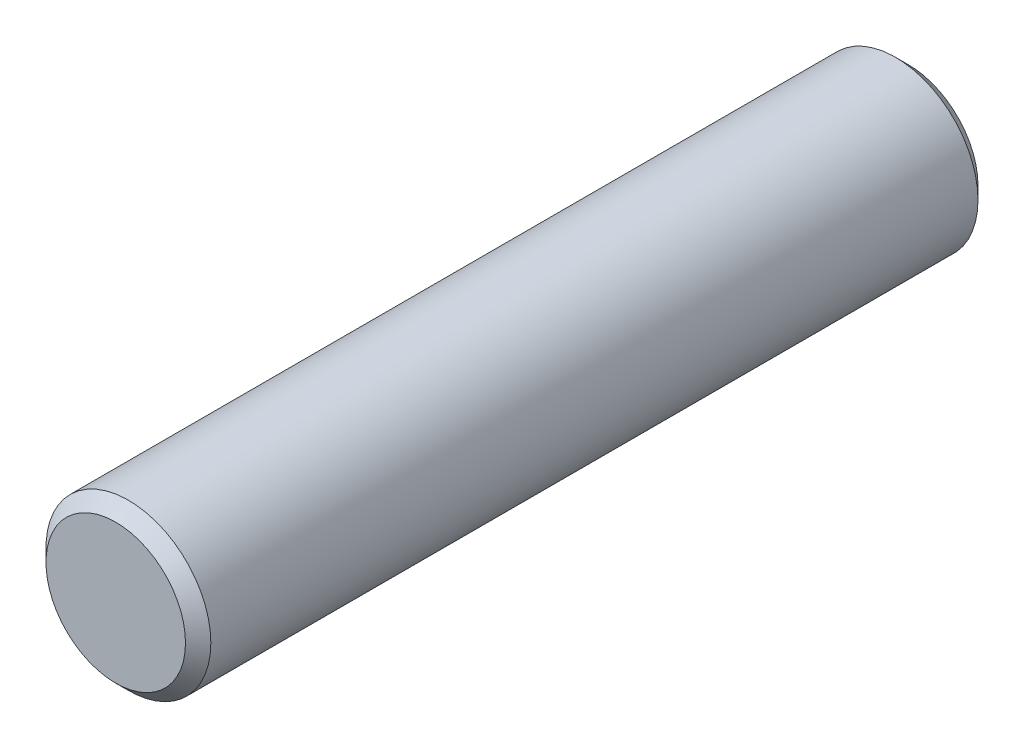
ISO-10303-21;
HEADER;
FILE_DESCRIPTION(('STEP AP214'),'2;1');
FILE_NAME('part.step','',(''),(''),'','','');
FILE_SCHEMA(('AUTOMOTIVE_DESIGN { 1 0 10303 214 1 1 1 1 }'));
ENDSEC;
DATA;
#1=APPLICATION_CONTEXT('core data for automotive mechanical design processes');
#2=APPLICATION_PROTOCOL_DEFINITION('international standard','automotive_design',2000,#1);
#3=PRODUCT_CONTEXT('',#1,'mechanical');
#4=PRODUCT('Part','Part','',(#3));
#5=PRODUCT_RELATED_PRODUCT_CATEGORY('part','',(#4));
#6=PRODUCT_DEFINITION_FORMATION('','',#4);
#7=PRODUCT_DEFINITION_CONTEXT('part definition',#1,'design');
#8=PRODUCT_DEFINITION('design','',#6,#7);
#9=PRODUCT_DEFINITION_SHAPE('','',#8);
#10=(LENGTH_UNIT() NAMED_UNIT(*) SI_UNIT(.MILLI.,.METRE.));
#11=(NAMED_UNIT(*) PLANE_ANGLE_UNIT() SI_UNIT($,.RADIAN.));
#12=(NAMED_UNIT(*) SI_UNIT($,.STERADIAN.) SOLID_ANGLE_UNIT());
#13=UNCERTAINTY_MEASURE_WITH_UNIT(LENGTH_MEASURE(1.E-05),#10,'distance_accuracy_value','');
#14=(GEOMETRIC_REPRESENTATION_CONTEXT(3) GLOBAL_UNCERTAINTY_ASSIGNED_CONTEXT((#13)) GLOBAL_UNIT_ASSIGNED_CONTEXT((#10,
#11,#12)) REPRESENTATION_CONTEXT('',''));
#15=CARTESIAN_POINT('',(0.,0.,0.));
#16=DIRECTION('',(0.,0.,1.));
#17=DIRECTION('',(1.,0.,0.));
#18=AXIS2_PLACEMENT_3D('',#15,#16,#17);
#19=CARTESIAN_POINT('',(0.,0.,-15.875));
#20=DIRECTION('',(0.,0.,1.));
#21=DIRECTION('',(1.,0.,0.));
#22=AXIS2_PLACEMENT_3D('',#19,#20,#21);
#23=CYLINDRICAL_SURFACE('',#22,1.651);
#24=CARTESIAN_POINT('',(0.,0.,-15.621));
#25=DIRECTION('',(0.,0.,1.));
#26=DIRECTION('',(1.,0.,0.));
#27=AXIS2_PLACEMENT_3D('',#24,#25,#26);
#28=CIRCLE('',#27,1.651);
#29=CARTESIAN_POINT('',(1.651,0.,-15.621));
#30=VERTEX_POINT('',#29);
#31=EDGE_CURVE('E46',#30,#30,#28,.T.);
#32=ORIENTED_EDGE('',*,*,#31,.T.);
#33=EDGE_LOOP('',(#32));
#34=FACE_BOUND('',#33,.T.);
#35=CARTESIAN_POINT('',(0.,0.,-0.254000000000001));
#36=DIRECTION('',(0.,0.,1.));
#37=DIRECTION('',(1.,0.,0.));
#38=AXIS2_PLACEMENT_3D('',#35,#36,#37);
#39=CIRCLE('',#38,1.651);
#40=CARTESIAN_POINT('',(1.651,0.,-0.254000000000001));
#41=VERTEX_POINT('',#40);
#42=EDGE_CURVE('E50',#41,#41,#39,.F.);
#43=ORIENTED_EDGE('',*,*,#42,.T.);
#44=EDGE_LOOP('',(#43));
#45=FACE_BOUND('',#44,.T.);
#46=ADVANCED_FACE('F34',(#34,#45),#23,.T.);
#47=CARTESIAN_POINT('',(0.,0.,-15.875));
#48=DIRECTION('',(0.,0.,1.));
#49=DIRECTION('',(1.,0.,0.));
#50=AXIS2_PLACEMENT_3D('',#47,#48,#49);
#51=PLANE('',#50);
#52=CARTESIAN_POINT('',(0.,0.,-15.875));
#53=DIRECTION('',(0.,0.,1.));
#54=DIRECTION('',(1.,0.,0.));
#55=AXIS2_PLACEMENT_3D('',#52,#53,#54);
#56=CIRCLE('',#55,1.397);
#57=CARTESIAN_POINT('',(1.397,0.,-15.875));
#58=VERTEX_POINT('',#57);
#59=EDGE_CURVE('E42',#58,#58,#56,.F.);
#60=ORIENTED_EDGE('',*,*,#59,.T.);
#61=EDGE_LOOP('',(#60));
#62=FACE_BOUND('',#61,.T.);
#63=ADVANCED_FACE('F66',(#62),#51,.F.);
#64=CARTESIAN_POINT('',(0.,0.,0.));
#65=DIRECTION('',(0.,0.,1.));
#66=DIRECTION('',(1.,0.,0.));
#67=AXIS2_PLACEMENT_3D('',#64,#65,#66);
#68=PLANE('',#67);
#69=CARTESIAN_POINT('',(0.,0.,0.));
#70=DIRECTION('',(0.,0.,1.));
#71=DIRECTION('',(1.,0.,0.));
#72=AXIS2_PLACEMENT_3D('',#69,#70,#71);
#73=CIRCLE('',#72,1.397);
#74=CARTESIAN_POINT('',(1.397,0.,0.));
#75=VERTEX_POINT('',#74);
#76=EDGE_CURVE('E10',#75,#75,#73,.T.);
#77=ORIENTED_EDGE('',*,*,#76,.T.);
#78=EDGE_LOOP('',(#77));
#79=FACE_BOUND('',#78,.T.);
#80=ADVANCED_FACE('F63',(#79),#68,.T.);
#81=CARTESIAN_POINT('',(0.,0.,-15.621));
#82=DIRECTION('',(0.,0.,1.));
#83=DIRECTION('',(1.,0.,0.));
#84=AXIS2_PLACEMENT_3D('',#81,#82,#83);
#85=CONICAL_SURFACE('',#84,1.651,0.785398163397455);
#86=ORIENTED_EDGE('',*,*,#59,.F.);
#87=EDGE_LOOP('',(#86));
#88=FACE_BOUND('',#87,.T.);
#89=ORIENTED_EDGE('',*,*,#31,.F.);
#90=EDGE_LOOP('',(#89));
#91=FACE_BOUND('',#90,.T.);
#92=ADVANCED_FACE('F59',(#88,#91),#85,.T.);
#93=CARTESIAN_POINT('',(0.,0.,0.));
#94=DIRECTION('',(0.,0.,-1.));
#95=DIRECTION('',(-1.,0.,0.));
#96=AXIS2_PLACEMENT_3D('',#93,#94,#95);
#97=CONICAL_SURFACE('',#96,1.397,0.785398163397449);
#98=ORIENTED_EDGE('',*,*,#42,.F.);
#99=EDGE_LOOP('',(#98));
#100=FACE_BOUND('',#99,.T.);
#101=ORIENTED_EDGE('',*,*,#76,.F.);
#102=EDGE_LOOP('',(#101));
#103=FACE_BOUND('',#102,.T.);
#104=ADVANCED_FACE('F37',(#100,#103),#97,.T.);
#105=CLOSED_SHELL('',(#46,#63,#80,#92,#104));
#106=MANIFOLD_SOLID_BREP('B2',#105);
#107=ADVANCED_BREP_SHAPE_REPRESENTATION('',(#18,#106),#14);
#108=SHAPE_DEFINITION_REPRESENTATION(#9,#107);
ENDSEC;
END-ISO-10303-21;
